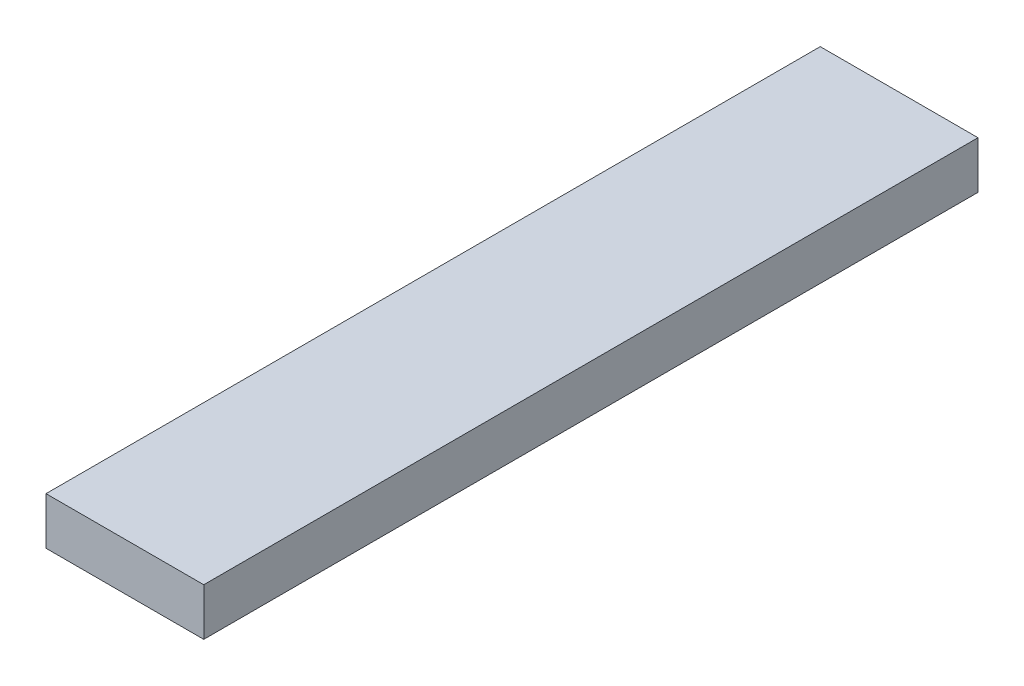
ISO-10303-21;
HEADER;
FILE_DESCRIPTION(('STEP AP214'),'2;1');
FILE_NAME('part.step','',(''),(''),'','','');
FILE_SCHEMA(('AUTOMOTIVE_DESIGN { 1 0 10303 214 1 1 1 1 }'));
ENDSEC;
DATA;
#1=APPLICATION_CONTEXT('core data for automotive mechanical design processes');
#2=APPLICATION_PROTOCOL_DEFINITION('international standard','automotive_design',2000,#1);
#3=PRODUCT_CONTEXT('',#1,'mechanical');
#4=PRODUCT('Part','Part','',(#3));
#5=PRODUCT_RELATED_PRODUCT_CATEGORY('part','',(#4));
#6=PRODUCT_DEFINITION_FORMATION('','',#4);
#7=PRODUCT_DEFINITION_CONTEXT('part definition',#1,'design');
#8=PRODUCT_DEFINITION('design','',#6,#7);
#9=PRODUCT_DEFINITION_SHAPE('','',#8);
#10=(LENGTH_UNIT() NAMED_UNIT(*) SI_UNIT(.MILLI.,.METRE.));
#11=(NAMED_UNIT(*) PLANE_ANGLE_UNIT() SI_UNIT($,.RADIAN.));
#12=(NAMED_UNIT(*) SI_UNIT($,.STERADIAN.) SOLID_ANGLE_UNIT());
#13=UNCERTAINTY_MEASURE_WITH_UNIT(LENGTH_MEASURE(1.E-05),#10,'distance_accuracy_value','');
#14=(GEOMETRIC_REPRESENTATION_CONTEXT(3) GLOBAL_UNCERTAINTY_ASSIGNED_CONTEXT((#13)) GLOBAL_UNIT_ASSIGNED_CONTEXT((#10,
#11,#12)) REPRESENTATION_CONTEXT('',''));
#15=CARTESIAN_POINT('',(0.,0.,0.));
#16=DIRECTION('',(0.,0.,1.));
#17=DIRECTION('',(1.,0.,0.));
#18=AXIS2_PLACEMENT_3D('',#15,#16,#17);
#19=CARTESIAN_POINT('',(0.,3.,0.));
#20=DIRECTION('',(1.,0.,0.));
#21=DIRECTION('',(0.,0.,-1.));
#22=AXIS2_PLACEMENT_3D('',#19,#20,#21);
#23=PLANE('',#22);
#24=DIRECTION('',(0.,0.,1.));
#25=VECTOR('',#24,1.);
#26=CARTESIAN_POINT('',(0.,0.,0.));
#27=LINE('',#26,#25);
#28=CARTESIAN_POINT('',(0.,0.,-49.08));
#29=VERTEX_POINT('',#28);
#30=CARTESIAN_POINT('',(0.,0.,0.));
#31=VERTEX_POINT('',#30);
#32=EDGE_CURVE('E98',#29,#31,#27,.T.);
#33=ORIENTED_EDGE('',*,*,#32,.T.);
#34=DIRECTION('',(0.,-1.,0.));
#35=VECTOR('',#34,1.);
#36=CARTESIAN_POINT('',(0.,3.,0.));
#37=LINE('',#36,#35);
#38=CARTESIAN_POINT('',(0.,3.,0.));
#39=VERTEX_POINT('',#38);
#40=EDGE_CURVE('E11',#39,#31,#37,.T.);
#41=ORIENTED_EDGE('',*,*,#40,.F.);
#42=DIRECTION('',(0.,0.,1.));
#43=VECTOR('',#42,1.);
#44=CARTESIAN_POINT('',(0.,3.,0.));
#45=LINE('',#44,#43);
#46=CARTESIAN_POINT('',(0.,3.,-49.08));
#47=VERTEX_POINT('',#46);
#48=EDGE_CURVE('E86',#47,#39,#45,.T.);
#49=ORIENTED_EDGE('',*,*,#48,.F.);
#50=DIRECTION('',(0.,-1.,0.));
#51=VECTOR('',#50,1.);
#52=CARTESIAN_POINT('',(0.,3.,-49.08));
#53=LINE('',#52,#51);
#54=EDGE_CURVE('E94',#47,#29,#53,.T.);
#55=ORIENTED_EDGE('',*,*,#54,.T.);
#56=EDGE_LOOP('',(#33,#41,#49,#55));
#57=FACE_BOUND('',#56,.T.);
#58=ADVANCED_FACE('F35',(#57),#23,.F.);
#59=CARTESIAN_POINT('',(0.,3.,0.));
#60=DIRECTION('',(0.,0.,-1.));
#61=DIRECTION('',(-1.,0.,0.));
#62=AXIS2_PLACEMENT_3D('',#59,#60,#61);
#63=PLANE('',#62);
#64=DIRECTION('',(1.,0.,0.));
#65=VECTOR('',#64,1.);
#66=CARTESIAN_POINT('',(0.,0.,0.));
#67=LINE('',#66,#65);
#68=CARTESIAN_POINT('',(10.,0.,0.));
#69=VERTEX_POINT('',#68);
#70=EDGE_CURVE('E90',#31,#69,#67,.T.);
#71=ORIENTED_EDGE('',*,*,#70,.T.);
#72=DIRECTION('',(0.,-1.,0.));
#73=VECTOR('',#72,1.);
#74=CARTESIAN_POINT('',(10.,3.,0.));
#75=LINE('',#74,#73);
#76=CARTESIAN_POINT('',(10.,3.,0.));
#77=VERTEX_POINT('',#76);
#78=EDGE_CURVE('E43',#77,#69,#75,.T.);
#79=ORIENTED_EDGE('',*,*,#78,.F.);
#80=DIRECTION('',(1.,0.,0.));
#81=VECTOR('',#80,1.);
#82=CARTESIAN_POINT('',(0.,3.,0.));
#83=LINE('',#82,#81);
#84=EDGE_CURVE('E81',#39,#77,#83,.T.);
#85=ORIENTED_EDGE('',*,*,#84,.F.);
#86=ORIENTED_EDGE('',*,*,#40,.T.);
#87=EDGE_LOOP('',(#71,#79,#85,#86));
#88=FACE_BOUND('',#87,.T.);
#89=ADVANCED_FACE('F89',(#88),#63,.F.);
#90=CARTESIAN_POINT('',(10.,3.,0.));
#91=DIRECTION('',(-1.,0.,0.));
#92=DIRECTION('',(0.,0.,1.));
#93=AXIS2_PLACEMENT_3D('',#90,#91,#92);
#94=PLANE('',#93);
#95=DIRECTION('',(0.,0.,-1.));
#96=VECTOR('',#95,1.);
#97=CARTESIAN_POINT('',(10.,0.,0.));
#98=LINE('',#97,#96);
#99=CARTESIAN_POINT('',(10.,0.,-49.08));
#100=VERTEX_POINT('',#99);
#101=EDGE_CURVE('E68',#69,#100,#98,.T.);
#102=ORIENTED_EDGE('',*,*,#101,.T.);
#103=DIRECTION('',(0.,-1.,0.));
#104=VECTOR('',#103,1.);
#105=CARTESIAN_POINT('',(10.,3.,-49.08));
#106=LINE('',#105,#104);
#107=CARTESIAN_POINT('',(10.,3.,-49.08));
#108=VERTEX_POINT('',#107);
#109=EDGE_CURVE('E91',#108,#100,#106,.T.);
#110=ORIENTED_EDGE('',*,*,#109,.F.);
#111=DIRECTION('',(0.,0.,-1.));
#112=VECTOR('',#111,1.);
#113=CARTESIAN_POINT('',(10.,3.,0.));
#114=LINE('',#113,#112);
#115=EDGE_CURVE('E84',#77,#108,#114,.T.);
#116=ORIENTED_EDGE('',*,*,#115,.F.);
#117=ORIENTED_EDGE('',*,*,#78,.T.);
#118=EDGE_LOOP('',(#102,#110,#116,#117));
#119=FACE_BOUND('',#118,.T.);
#120=ADVANCED_FACE('F92',(#119),#94,.F.);
#121=CARTESIAN_POINT('',(0.,3.,-49.08));
#122=DIRECTION('',(0.,0.,1.));
#123=DIRECTION('',(1.,0.,0.));
#124=AXIS2_PLACEMENT_3D('',#121,#122,#123);
#125=PLANE('',#124);
#126=DIRECTION('',(-1.,0.,0.));
#127=VECTOR('',#126,1.);
#128=CARTESIAN_POINT('',(0.,0.,-49.08));
#129=LINE('',#128,#127);
#130=EDGE_CURVE('E74',#100,#29,#129,.T.);
#131=ORIENTED_EDGE('',*,*,#130,.T.);
#132=ORIENTED_EDGE('',*,*,#54,.F.);
#133=DIRECTION('',(-1.,0.,0.));
#134=VECTOR('',#133,1.);
#135=CARTESIAN_POINT('',(0.,3.,-49.08));
#136=LINE('',#135,#134);
#137=EDGE_CURVE('E51',#108,#47,#136,.T.);
#138=ORIENTED_EDGE('',*,*,#137,.F.);
#139=ORIENTED_EDGE('',*,*,#109,.T.);
#140=EDGE_LOOP('',(#131,#132,#138,#139));
#141=FACE_BOUND('',#140,.T.);
#142=ADVANCED_FACE('F105',(#141),#125,.F.);
#143=CARTESIAN_POINT('',(0.,3.,0.));
#144=DIRECTION('',(0.,-1.,0.));
#145=DIRECTION('',(0.,0.,-1.));
#146=AXIS2_PLACEMENT_3D('',#143,#144,#145);
#147=PLANE('',#146);
#148=ORIENTED_EDGE('',*,*,#48,.T.);
#149=ORIENTED_EDGE('',*,*,#84,.T.);
#150=ORIENTED_EDGE('',*,*,#115,.T.);
#151=ORIENTED_EDGE('',*,*,#137,.T.);
#152=EDGE_LOOP('',(#148,#149,#150,#151));
#153=FACE_BOUND('',#152,.T.);
#154=ADVANCED_FACE('F82',(#153),#147,.F.);
#155=CARTESIAN_POINT('',(0.,0.,0.));
#156=DIRECTION('',(0.,-1.,0.));
#157=DIRECTION('',(0.,0.,-1.));
#158=AXIS2_PLACEMENT_3D('',#155,#156,#157);
#159=PLANE('',#158);
#160=ORIENTED_EDGE('',*,*,#32,.F.);
#161=ORIENTED_EDGE('',*,*,#130,.F.);
#162=ORIENTED_EDGE('',*,*,#101,.F.);
#163=ORIENTED_EDGE('',*,*,#70,.F.);
#164=EDGE_LOOP('',(#160,#161,#162,#163));
#165=FACE_BOUND('',#164,.T.);
#166=ADVANCED_FACE('F108',(#165),#159,.T.);
#167=CLOSED_SHELL('',(#58,#89,#120,#142,#154,#166));
#168=MANIFOLD_SOLID_BREP('B2',#167);
#169=ADVANCED_BREP_SHAPE_REPRESENTATION('',(#18,#168),#14);
#170=SHAPE_DEFINITION_REPRESENTATION(#9,#169);
ENDSEC;
END-ISO-10303-21;
